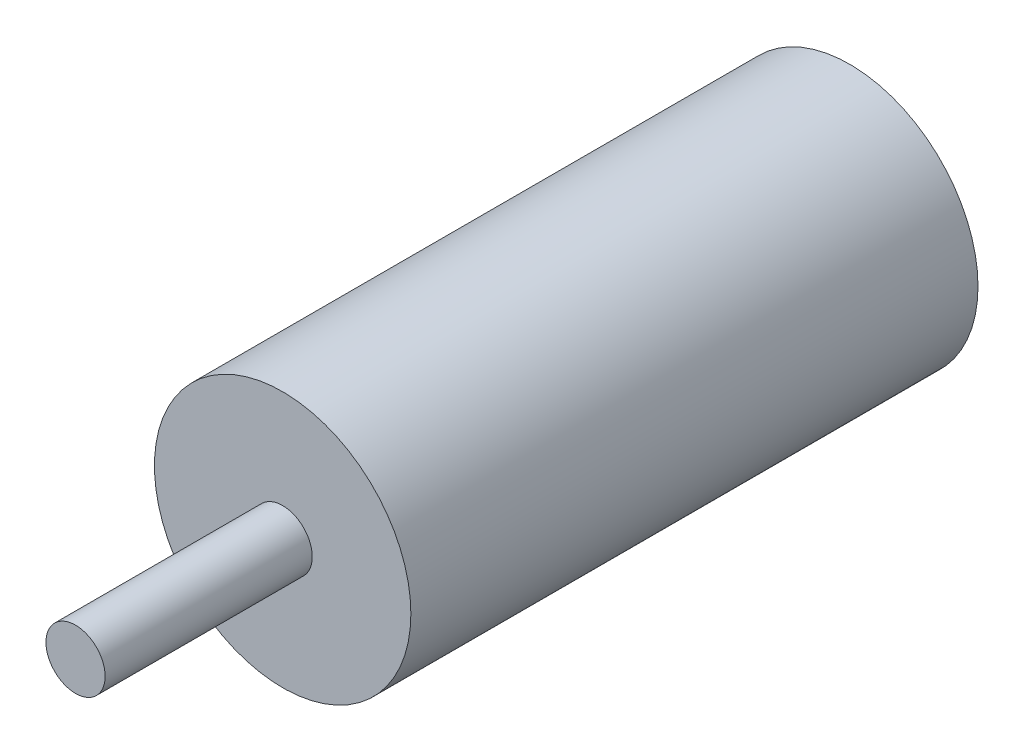
ISO-10303-21;
HEADER;
FILE_DESCRIPTION(('STEP AP214'),'2;1');
FILE_NAME('part.step','',(''),(''),'','','');
FILE_SCHEMA(('AUTOMOTIVE_DESIGN { 1 0 10303 214 1 1 1 1 }'));
ENDSEC;
DATA;
#1=APPLICATION_CONTEXT('core data for automotive mechanical design processes');
#2=APPLICATION_PROTOCOL_DEFINITION('international standard','automotive_design',2000,#1);
#3=PRODUCT_CONTEXT('',#1,'mechanical');
#4=PRODUCT('Part','Part','',(#3));
#5=PRODUCT_RELATED_PRODUCT_CATEGORY('part','',(#4));
#6=PRODUCT_DEFINITION_FORMATION('','',#4);
#7=PRODUCT_DEFINITION_CONTEXT('part definition',#1,'design');
#8=PRODUCT_DEFINITION('design','',#6,#7);
#9=PRODUCT_DEFINITION_SHAPE('','',#8);
#10=(LENGTH_UNIT() NAMED_UNIT(*) SI_UNIT(.MILLI.,.METRE.));
#11=(NAMED_UNIT(*) PLANE_ANGLE_UNIT() SI_UNIT($,.RADIAN.));
#12=(NAMED_UNIT(*) SI_UNIT($,.STERADIAN.) SOLID_ANGLE_UNIT());
#13=UNCERTAINTY_MEASURE_WITH_UNIT(LENGTH_MEASURE(1.E-05),#10,'distance_accuracy_value','');
#14=(GEOMETRIC_REPRESENTATION_CONTEXT(3) GLOBAL_UNCERTAINTY_ASSIGNED_CONTEXT((#13)) GLOBAL_UNIT_ASSIGNED_CONTEXT((#10,
#11,#12)) REPRESENTATION_CONTEXT('',''));
#15=CARTESIAN_POINT('',(0.,0.,0.));
#16=DIRECTION('',(0.,0.,1.));
#17=DIRECTION('',(1.,0.,0.));
#18=AXIS2_PLACEMENT_3D('',#15,#16,#17);
#19=CARTESIAN_POINT('',(0.,0.,115.));
#20=DIRECTION('',(0.,0.,-1.));
#21=DIRECTION('',(-1.,0.,0.));
#22=AXIS2_PLACEMENT_3D('',#19,#20,#21);
#23=CYLINDRICAL_SURFACE('',#22,26.);
#24=CARTESIAN_POINT('',(0.,0.,115.));
#25=DIRECTION('',(0.,0.,1.));
#26=DIRECTION('',(1.,0.,0.));
#27=AXIS2_PLACEMENT_3D('',#24,#25,#26);
#28=CIRCLE('',#27,26.);
#29=CARTESIAN_POINT('',(26.,0.,115.));
#30=VERTEX_POINT('',#29);
#31=EDGE_CURVE('E38',#30,#30,#28,.T.);
#32=ORIENTED_EDGE('',*,*,#31,.F.);
#33=EDGE_LOOP('',(#32));
#34=FACE_BOUND('',#33,.T.);
#35=CARTESIAN_POINT('',(0.,0.,0.));
#36=DIRECTION('',(0.,0.,1.));
#37=DIRECTION('',(1.,0.,0.));
#38=AXIS2_PLACEMENT_3D('',#35,#36,#37);
#39=CIRCLE('',#38,26.);
#40=CARTESIAN_POINT('',(26.,0.,0.));
#41=VERTEX_POINT('',#40);
#42=EDGE_CURVE('E34',#41,#41,#39,.T.);
#43=ORIENTED_EDGE('',*,*,#42,.T.);
#44=EDGE_LOOP('',(#43));
#45=FACE_BOUND('',#44,.T.);
#46=ADVANCED_FACE('F31',(#34,#45),#23,.T.);
#47=CARTESIAN_POINT('',(0.,0.,115.));
#48=DIRECTION('',(0.,0.,1.));
#49=DIRECTION('',(1.,0.,0.));
#50=AXIS2_PLACEMENT_3D('',#47,#48,#49);
#51=PLANE('',#50);
#52=CARTESIAN_POINT('',(0.,0.,115.));
#53=DIRECTION('',(0.,0.,1.));
#54=DIRECTION('',(1.,0.,0.));
#55=AXIS2_PLACEMENT_3D('',#52,#53,#54);
#56=CIRCLE('',#55,6.);
#57=CARTESIAN_POINT('',(6.,0.,115.));
#58=VERTEX_POINT('',#57);
#59=EDGE_CURVE('E10',#58,#58,#56,.T.);
#60=ORIENTED_EDGE('',*,*,#59,.F.);
#61=EDGE_LOOP('',(#60));
#62=FACE_BOUND('',#61,.T.);
#63=ORIENTED_EDGE('',*,*,#31,.T.);
#64=EDGE_LOOP('',(#63));
#65=FACE_BOUND('',#64,.T.);
#66=ADVANCED_FACE('F55',(#62,#65),#51,.T.);
#67=CARTESIAN_POINT('',(0.,0.,0.));
#68=DIRECTION('',(0.,0.,1.));
#69=DIRECTION('',(1.,0.,0.));
#70=AXIS2_PLACEMENT_3D('',#67,#68,#69);
#71=PLANE('',#70);
#72=ORIENTED_EDGE('',*,*,#42,.F.);
#73=EDGE_LOOP('',(#72));
#74=FACE_BOUND('',#73,.T.);
#75=ADVANCED_FACE('F52',(#74),#71,.F.);
#76=CARTESIAN_POINT('',(0.,0.,157.));
#77=DIRECTION('',(0.,0.,-1.));
#78=DIRECTION('',(-1.,0.,0.));
#79=AXIS2_PLACEMENT_3D('',#76,#77,#78);
#80=CYLINDRICAL_SURFACE('',#79,6.);
#81=CARTESIAN_POINT('',(0.,0.,157.));
#82=DIRECTION('',(0.,0.,1.));
#83=DIRECTION('',(1.,0.,0.));
#84=AXIS2_PLACEMENT_3D('',#81,#82,#83);
#85=CIRCLE('',#84,6.);
#86=CARTESIAN_POINT('',(6.,0.,157.));
#87=VERTEX_POINT('',#86);
#88=EDGE_CURVE('E44',#87,#87,#85,.T.);
#89=ORIENTED_EDGE('',*,*,#88,.F.);
#90=EDGE_LOOP('',(#89));
#91=FACE_BOUND('',#90,.T.);
#92=ORIENTED_EDGE('',*,*,#59,.T.);
#93=EDGE_LOOP('',(#92));
#94=FACE_BOUND('',#93,.T.);
#95=ADVANCED_FACE('F54',(#91,#94),#80,.T.);
#96=CARTESIAN_POINT('',(0.,0.,157.));
#97=DIRECTION('',(0.,0.,1.));
#98=DIRECTION('',(1.,0.,0.));
#99=AXIS2_PLACEMENT_3D('',#96,#97,#98);
#100=PLANE('',#99);
#101=ORIENTED_EDGE('',*,*,#88,.T.);
#102=EDGE_LOOP('',(#101));
#103=FACE_BOUND('',#102,.T.);
#104=ADVANCED_FACE('F60',(#103),#100,.T.);
#105=CLOSED_SHELL('',(#46,#66,#75,#95,#104));
#106=MANIFOLD_SOLID_BREP('B2',#105);
#107=ADVANCED_BREP_SHAPE_REPRESENTATION('',(#18,#106),#14);
#108=SHAPE_DEFINITION_REPRESENTATION(#9,#107);
ENDSEC;
END-ISO-10303-21;
